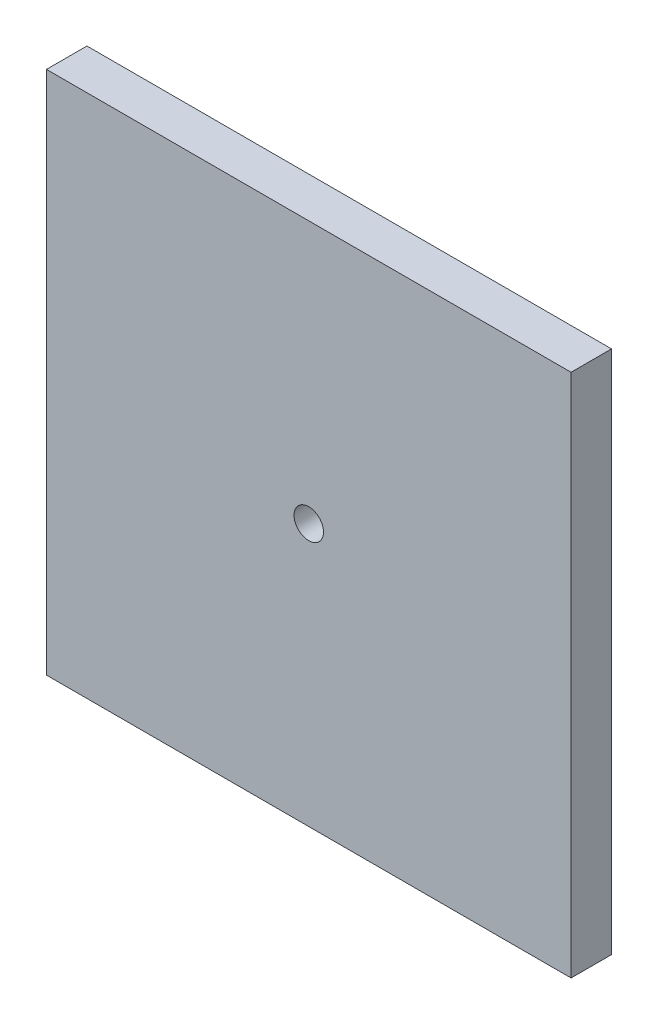
ISO-10303-21;
HEADER;
FILE_DESCRIPTION(('STEP AP214'),'2;1');
FILE_NAME('part.step','',(''),(''),'','','');
FILE_SCHEMA(('AUTOMOTIVE_DESIGN { 1 0 10303 214 1 1 1 1 }'));
ENDSEC;
DATA;
#1=APPLICATION_CONTEXT('core data for automotive mechanical design processes');
#2=APPLICATION_PROTOCOL_DEFINITION('international standard','automotive_design',2000,#1);
#3=PRODUCT_CONTEXT('',#1,'mechanical');
#4=PRODUCT('Part','Part','',(#3));
#5=PRODUCT_RELATED_PRODUCT_CATEGORY('part','',(#4));
#6=PRODUCT_DEFINITION_FORMATION('','',#4);
#7=PRODUCT_DEFINITION_CONTEXT('part definition',#1,'design');
#8=PRODUCT_DEFINITION('design','',#6,#7);
#9=PRODUCT_DEFINITION_SHAPE('','',#8);
#10=(LENGTH_UNIT() NAMED_UNIT(*) SI_UNIT(.MILLI.,.METRE.));
#11=(NAMED_UNIT(*) PLANE_ANGLE_UNIT() SI_UNIT($,.RADIAN.));
#12=(NAMED_UNIT(*) SI_UNIT($,.STERADIAN.) SOLID_ANGLE_UNIT());
#13=UNCERTAINTY_MEASURE_WITH_UNIT(LENGTH_MEASURE(1.E-05),#10,'distance_accuracy_value','');
#14=(GEOMETRIC_REPRESENTATION_CONTEXT(3) GLOBAL_UNCERTAINTY_ASSIGNED_CONTEXT((#13)) GLOBAL_UNIT_ASSIGNED_CONTEXT((#10,
#11,#12)) REPRESENTATION_CONTEXT('',''));
#15=CARTESIAN_POINT('',(0.,0.,0.));
#16=DIRECTION('',(0.,0.,1.));
#17=DIRECTION('',(1.,0.,0.));
#18=AXIS2_PLACEMENT_3D('',#15,#16,#17);
#19=CARTESIAN_POINT('',(56.5785,0.,8.73125));
#20=DIRECTION('',(1.,0.,0.));
#21=DIRECTION('',(0.,1.,0.));
#22=AXIS2_PLACEMENT_3D('',#19,#20,#21);
#23=PLANE('',#22);
#24=DIRECTION('',(0.,-1.,0.));
#25=VECTOR('',#24,1.);
#26=CARTESIAN_POINT('',(56.5785,0.,0.));
#27=LINE('',#26,#25);
#28=CARTESIAN_POINT('',(56.5785,56.5785,0.));
#29=VERTEX_POINT('',#28);
#30=CARTESIAN_POINT('',(56.5785,-56.5785,0.));
#31=VERTEX_POINT('',#30);
#32=EDGE_CURVE('E106',#29,#31,#27,.T.);
#33=ORIENTED_EDGE('',*,*,#32,.F.);
#34=DIRECTION('',(0.,0.,-1.));
#35=VECTOR('',#34,1.);
#36=CARTESIAN_POINT('',(56.5785,56.5785,8.73125));
#37=LINE('',#36,#35);
#38=CARTESIAN_POINT('',(56.5785,56.5785,8.73125));
#39=VERTEX_POINT('',#38);
#40=EDGE_CURVE('E11',#39,#29,#37,.T.);
#41=ORIENTED_EDGE('',*,*,#40,.F.);
#42=DIRECTION('',(0.,-1.,0.));
#43=VECTOR('',#42,1.);
#44=CARTESIAN_POINT('',(56.5785,0.,8.73125));
#45=LINE('',#44,#43);
#46=CARTESIAN_POINT('',(56.5785,-56.5785,8.73125));
#47=VERTEX_POINT('',#46);
#48=EDGE_CURVE('E96',#39,#47,#45,.T.);
#49=ORIENTED_EDGE('',*,*,#48,.T.);
#50=DIRECTION('',(0.,0.,-1.));
#51=VECTOR('',#50,1.);
#52=CARTESIAN_POINT('',(56.5785,-56.5785,8.73125));
#53=LINE('',#52,#51);
#54=EDGE_CURVE('E76',#47,#31,#53,.T.);
#55=ORIENTED_EDGE('',*,*,#54,.T.);
#56=EDGE_LOOP('',(#33,#41,#49,#55));
#57=FACE_BOUND('',#56,.T.);
#58=ADVANCED_FACE('F38',(#57),#23,.T.);
#59=CARTESIAN_POINT('',(0.,56.5785,8.73125));
#60=DIRECTION('',(0.,1.,0.));
#61=DIRECTION('',(0.,0.,1.));
#62=AXIS2_PLACEMENT_3D('',#59,#60,#61);
#63=PLANE('',#62);
#64=DIRECTION('',(1.,0.,0.));
#65=VECTOR('',#64,1.);
#66=CARTESIAN_POINT('',(0.,56.5785,0.));
#67=LINE('',#66,#65);
#68=CARTESIAN_POINT('',(-56.5785,56.5785,0.));
#69=VERTEX_POINT('',#68);
#70=EDGE_CURVE('E89',#69,#29,#67,.T.);
#71=ORIENTED_EDGE('',*,*,#70,.F.);
#72=DIRECTION('',(0.,0.,-1.));
#73=VECTOR('',#72,1.);
#74=CARTESIAN_POINT('',(-56.5785,56.5785,8.73125));
#75=LINE('',#74,#73);
#76=CARTESIAN_POINT('',(-56.5785,56.5785,8.73125));
#77=VERTEX_POINT('',#76);
#78=EDGE_CURVE('E46',#77,#69,#75,.T.);
#79=ORIENTED_EDGE('',*,*,#78,.F.);
#80=DIRECTION('',(1.,0.,0.));
#81=VECTOR('',#80,1.);
#82=CARTESIAN_POINT('',(0.,56.5785,8.73125));
#83=LINE('',#82,#81);
#84=EDGE_CURVE('E87',#77,#39,#83,.T.);
#85=ORIENTED_EDGE('',*,*,#84,.T.);
#86=ORIENTED_EDGE('',*,*,#40,.T.);
#87=EDGE_LOOP('',(#71,#79,#85,#86));
#88=FACE_BOUND('',#87,.T.);
#89=ADVANCED_FACE('F85',(#88),#63,.T.);
#90=CARTESIAN_POINT('',(-56.5785000000002,1.87350135405496E-13,8.73125));
#91=DIRECTION('',(1.,0.,0.));
#92=DIRECTION('',(0.,1.,0.));
#93=AXIS2_PLACEMENT_3D('',#90,#91,#92);
#94=PLANE('',#93);
#95=DIRECTION('',(0.,-1.,0.));
#96=VECTOR('',#95,1.);
#97=CARTESIAN_POINT('',(-56.5785000000002,1.87350135405496E-13,0.));
#98=LINE('',#97,#96);
#99=CARTESIAN_POINT('',(-56.5785000000004,-56.5785,0.));
#100=VERTEX_POINT('',#99);
#101=EDGE_CURVE('E69',#69,#100,#98,.T.);
#102=ORIENTED_EDGE('',*,*,#101,.T.);
#103=DIRECTION('',(0.,0.,-1.));
#104=VECTOR('',#103,1.);
#105=CARTESIAN_POINT('',(-56.5785000000004,-56.5785,8.73125));
#106=LINE('',#105,#104);
#107=CARTESIAN_POINT('',(-56.5785000000004,-56.5785,8.73125));
#108=VERTEX_POINT('',#107);
#109=EDGE_CURVE('E90',#108,#100,#106,.T.);
#110=ORIENTED_EDGE('',*,*,#109,.F.);
#111=DIRECTION('',(0.,-1.,0.));
#112=VECTOR('',#111,1.);
#113=CARTESIAN_POINT('',(-56.5785000000002,1.87350135405496E-13,8.73125));
#114=LINE('',#113,#112);
#115=EDGE_CURVE('E91',#77,#108,#114,.T.);
#116=ORIENTED_EDGE('',*,*,#115,.F.);
#117=ORIENTED_EDGE('',*,*,#78,.T.);
#118=EDGE_LOOP('',(#102,#110,#116,#117));
#119=FACE_BOUND('',#118,.T.);
#120=ADVANCED_FACE('F92',(#119),#94,.F.);
#121=CARTESIAN_POINT('',(0.,-56.5785,8.73125));
#122=DIRECTION('',(0.,1.,0.));
#123=DIRECTION('',(0.,0.,1.));
#124=AXIS2_PLACEMENT_3D('',#121,#122,#123);
#125=PLANE('',#124);
#126=DIRECTION('',(1.,0.,0.));
#127=VECTOR('',#126,1.);
#128=CARTESIAN_POINT('',(0.,-56.5785,0.));
#129=LINE('',#128,#127);
#130=EDGE_CURVE('E112',#100,#31,#129,.T.);
#131=ORIENTED_EDGE('',*,*,#130,.T.);
#132=ORIENTED_EDGE('',*,*,#54,.F.);
#133=DIRECTION('',(1.,0.,0.));
#134=VECTOR('',#133,1.);
#135=CARTESIAN_POINT('',(0.,-56.5785,8.73125));
#136=LINE('',#135,#134);
#137=EDGE_CURVE('E54',#108,#47,#136,.T.);
#138=ORIENTED_EDGE('',*,*,#137,.F.);
#139=ORIENTED_EDGE('',*,*,#109,.T.);
#140=EDGE_LOOP('',(#131,#132,#138,#139));
#141=FACE_BOUND('',#140,.T.);
#142=ADVANCED_FACE('F119',(#141),#125,.F.);
#143=CARTESIAN_POINT('',(0.,0.,8.73125));
#144=DIRECTION('',(0.,0.,-1.));
#145=DIRECTION('',(-1.,0.,0.));
#146=AXIS2_PLACEMENT_3D('',#143,#144,#145);
#147=CYLINDRICAL_SURFACE('',#146,3.175);
#148=CARTESIAN_POINT('',(0.,0.,8.73125));
#149=DIRECTION('',(0.,0.,1.));
#150=DIRECTION('',(1.,0.,0.));
#151=AXIS2_PLACEMENT_3D('',#148,#149,#150);
#152=CIRCLE('',#151,3.175);
#153=CARTESIAN_POINT('',(3.175,0.,8.73125));
#154=VERTEX_POINT('',#153);
#155=EDGE_CURVE('E103',#154,#154,#152,.T.);
#156=ORIENTED_EDGE('',*,*,#155,.T.);
#157=EDGE_LOOP('',(#156));
#158=FACE_BOUND('',#157,.T.);
#159=CARTESIAN_POINT('',(0.,0.,0.));
#160=DIRECTION('',(0.,0.,1.));
#161=DIRECTION('',(1.,0.,0.));
#162=AXIS2_PLACEMENT_3D('',#159,#160,#161);
#163=CIRCLE('',#162,3.175);
#164=CARTESIAN_POINT('',(3.175,0.,0.));
#165=VERTEX_POINT('',#164);
#166=EDGE_CURVE('E98',#165,#165,#163,.T.);
#167=ORIENTED_EDGE('',*,*,#166,.F.);
#168=EDGE_LOOP('',(#167));
#169=FACE_BOUND('',#168,.T.);
#170=ADVANCED_FACE('F134',(#158,#169),#147,.F.);
#171=CARTESIAN_POINT('',(0.,0.,8.73125));
#172=DIRECTION('',(0.,0.,1.));
#173=DIRECTION('',(1.,0.,0.));
#174=AXIS2_PLACEMENT_3D('',#171,#172,#173);
#175=PLANE('',#174);
#176=ORIENTED_EDGE('',*,*,#48,.F.);
#177=ORIENTED_EDGE('',*,*,#84,.F.);
#178=ORIENTED_EDGE('',*,*,#115,.T.);
#179=ORIENTED_EDGE('',*,*,#137,.T.);
#180=EDGE_LOOP('',(#176,#177,#178,#179));
#181=FACE_BOUND('',#180,.T.);
#182=ORIENTED_EDGE('',*,*,#155,.F.);
#183=EDGE_LOOP('',(#182));
#184=FACE_BOUND('',#183,.T.);
#185=ADVANCED_FACE('F94',(#181,#184),#175,.T.);
#186=CARTESIAN_POINT('',(0.,0.,0.));
#187=DIRECTION('',(0.,0.,1.));
#188=DIRECTION('',(1.,0.,0.));
#189=AXIS2_PLACEMENT_3D('',#186,#187,#188);
#190=PLANE('',#189);
#191=CARTESIAN_POINT('',(43.8785,-43.8785,0.));
#192=DIRECTION('',(0.,0.,1.));
#193=DIRECTION('',(1.,0.,0.));
#194=AXIS2_PLACEMENT_3D('',#191,#192,#193);
#195=CIRCLE('',#194,3.17500000000001);
#196=CARTESIAN_POINT('',(47.0535000000001,-43.8785,0.));
#197=VERTEX_POINT('',#196);
#198=EDGE_CURVE('E180',#197,#197,#195,.T.);
#199=ORIENTED_EDGE('',*,*,#198,.T.);
#200=EDGE_LOOP('',(#199));
#201=FACE_BOUND('',#200,.T.);
#202=CARTESIAN_POINT('',(-43.8785,-43.8785,0.));
#203=DIRECTION('',(0.,0.,1.));
#204=DIRECTION('',(1.,0.,0.));
#205=AXIS2_PLACEMENT_3D('',#202,#203,#204);
#206=CIRCLE('',#205,3.17499999999998);
#207=CARTESIAN_POINT('',(-40.7035,-43.8785,0.));
#208=VERTEX_POINT('',#207);
#209=EDGE_CURVE('E179',#208,#208,#206,.T.);
#210=ORIENTED_EDGE('',*,*,#209,.T.);
#211=EDGE_LOOP('',(#210));
#212=FACE_BOUND('',#211,.T.);
#213=CARTESIAN_POINT('',(-43.8785,43.8785,0.));
#214=DIRECTION('',(0.,0.,1.));
#215=DIRECTION('',(1.,0.,0.));
#216=AXIS2_PLACEMENT_3D('',#213,#214,#215);
#217=CIRCLE('',#216,3.17500000000001);
#218=CARTESIAN_POINT('',(-40.7035,43.8785,0.));
#219=VERTEX_POINT('',#218);
#220=EDGE_CURVE('E189',#219,#219,#217,.T.);
#221=ORIENTED_EDGE('',*,*,#220,.T.);
#222=EDGE_LOOP('',(#221));
#223=FACE_BOUND('',#222,.T.);
#224=CARTESIAN_POINT('',(43.8785,43.8785,0.));
#225=DIRECTION('',(0.,0.,1.));
#226=DIRECTION('',(1.,0.,0.));
#227=AXIS2_PLACEMENT_3D('',#224,#225,#226);
#228=CIRCLE('',#227,3.17499999999998);
#229=CARTESIAN_POINT('',(47.0535,43.8785,0.));
#230=VERTEX_POINT('',#229);
#231=EDGE_CURVE('E194',#230,#230,#228,.T.);
#232=ORIENTED_EDGE('',*,*,#231,.T.);
#233=EDGE_LOOP('',(#232));
#234=FACE_BOUND('',#233,.T.);
#235=ORIENTED_EDGE('',*,*,#32,.T.);
#236=ORIENTED_EDGE('',*,*,#130,.F.);
#237=ORIENTED_EDGE('',*,*,#101,.F.);
#238=ORIENTED_EDGE('',*,*,#70,.T.);
#239=EDGE_LOOP('',(#235,#236,#237,#238));
#240=FACE_BOUND('',#239,.T.);
#241=ORIENTED_EDGE('',*,*,#166,.T.);
#242=EDGE_LOOP('',(#241));
#243=FACE_BOUND('',#242,.T.);
#244=ADVANCED_FACE('F121',(#201,#212,#223,#234,#240,#243),#190,.F.);
#245=CARTESIAN_POINT('',(43.8785,43.8785,-9.398));
#246=DIRECTION('',(0.,0.,1.));
#247=DIRECTION('',(1.,0.,0.));
#248=AXIS2_PLACEMENT_3D('',#245,#246,#247);
#249=CYLINDRICAL_SURFACE('',#248,3.17499999999998);
#250=CARTESIAN_POINT('',(43.8785,43.8785,-9.398));
#251=DIRECTION('',(0.,0.,1.));
#252=DIRECTION('',(1.,0.,0.));
#253=AXIS2_PLACEMENT_3D('',#250,#251,#252);
#254=CIRCLE('',#253,3.17499999999998);
#255=CARTESIAN_POINT('',(47.0535,43.8785,-9.398));
#256=VERTEX_POINT('',#255);
#257=EDGE_CURVE('E109',#256,#256,#254,.T.);
#258=ORIENTED_EDGE('',*,*,#257,.T.);
#259=EDGE_LOOP('',(#258));
#260=FACE_BOUND('',#259,.T.);
#261=ORIENTED_EDGE('',*,*,#231,.F.);
#262=EDGE_LOOP('',(#261));
#263=FACE_BOUND('',#262,.T.);
#264=ADVANCED_FACE('F140',(#260,#263),#249,.T.);
#265=CARTESIAN_POINT('',(0.,0.,-9.398));
#266=DIRECTION('',(0.,0.,1.));
#267=DIRECTION('',(1.,0.,0.));
#268=AXIS2_PLACEMENT_3D('',#265,#266,#267);
#269=PLANE('',#268);
#270=ORIENTED_EDGE('',*,*,#257,.F.);
#271=EDGE_LOOP('',(#270));
#272=FACE_BOUND('',#271,.T.);
#273=ADVANCED_FACE('F146',(#272),#269,.F.);
#274=CARTESIAN_POINT('',(-43.8785,43.8785,-9.398));
#275=DIRECTION('',(0.,0.,1.));
#276=DIRECTION('',(1.,0.,0.));
#277=AXIS2_PLACEMENT_3D('',#274,#275,#276);
#278=CYLINDRICAL_SURFACE('',#277,3.17500000000001);
#279=CARTESIAN_POINT('',(-43.8785,43.8785,-9.398));
#280=DIRECTION('',(0.,0.,1.));
#281=DIRECTION('',(1.,0.,0.));
#282=AXIS2_PLACEMENT_3D('',#279,#280,#281);
#283=CIRCLE('',#282,3.17500000000001);
#284=CARTESIAN_POINT('',(-40.7035,43.8785,-9.398));
#285=VERTEX_POINT('',#284);
#286=EDGE_CURVE('E191',#285,#285,#283,.T.);
#287=ORIENTED_EDGE('',*,*,#286,.T.);
#288=EDGE_LOOP('',(#287));
#289=FACE_BOUND('',#288,.T.);
#290=ORIENTED_EDGE('',*,*,#220,.F.);
#291=EDGE_LOOP('',(#290));
#292=FACE_BOUND('',#291,.T.);
#293=ADVANCED_FACE('F150',(#289,#292),#278,.T.);
#294=CARTESIAN_POINT('',(0.,0.,-9.398));
#295=DIRECTION('',(0.,0.,1.));
#296=DIRECTION('',(1.,0.,0.));
#297=AXIS2_PLACEMENT_3D('',#294,#295,#296);
#298=PLANE('',#297);
#299=ORIENTED_EDGE('',*,*,#286,.F.);
#300=EDGE_LOOP('',(#299));
#301=FACE_BOUND('',#300,.T.);
#302=ADVANCED_FACE('F154',(#301),#298,.F.);
#303=CARTESIAN_POINT('',(-43.8785,-43.8785,-9.398));
#304=DIRECTION('',(0.,0.,1.));
#305=DIRECTION('',(1.,0.,0.));
#306=AXIS2_PLACEMENT_3D('',#303,#304,#305);
#307=CYLINDRICAL_SURFACE('',#306,3.17499999999998);
#308=CARTESIAN_POINT('',(-43.8785,-43.8785,-9.398));
#309=DIRECTION('',(0.,0.,1.));
#310=DIRECTION('',(1.,0.,0.));
#311=AXIS2_PLACEMENT_3D('',#308,#309,#310);
#312=CIRCLE('',#311,3.17499999999998);
#313=CARTESIAN_POINT('',(-40.7035,-43.8785,-9.398));
#314=VERTEX_POINT('',#313);
#315=EDGE_CURVE('E183',#314,#314,#312,.T.);
#316=ORIENTED_EDGE('',*,*,#315,.T.);
#317=EDGE_LOOP('',(#316));
#318=FACE_BOUND('',#317,.T.);
#319=ORIENTED_EDGE('',*,*,#209,.F.);
#320=EDGE_LOOP('',(#319));
#321=FACE_BOUND('',#320,.T.);
#322=ADVANCED_FACE('F158',(#318,#321),#307,.T.);
#323=CARTESIAN_POINT('',(0.,0.,-9.398));
#324=DIRECTION('',(0.,0.,1.));
#325=DIRECTION('',(1.,0.,0.));
#326=AXIS2_PLACEMENT_3D('',#323,#324,#325);
#327=PLANE('',#326);
#328=ORIENTED_EDGE('',*,*,#315,.F.);
#329=EDGE_LOOP('',(#328));
#330=FACE_BOUND('',#329,.T.);
#331=ADVANCED_FACE('F162',(#330),#327,.F.);
#332=CARTESIAN_POINT('',(43.8785,-43.8785,-9.398));
#333=DIRECTION('',(0.,0.,1.));
#334=DIRECTION('',(1.,0.,0.));
#335=AXIS2_PLACEMENT_3D('',#332,#333,#334);
#336=CYLINDRICAL_SURFACE('',#335,3.17500000000001);
#337=CARTESIAN_POINT('',(43.8785,-43.8785,-9.398));
#338=DIRECTION('',(0.,0.,1.));
#339=DIRECTION('',(1.,0.,0.));
#340=AXIS2_PLACEMENT_3D('',#337,#338,#339);
#341=CIRCLE('',#340,3.17500000000001);
#342=CARTESIAN_POINT('',(47.0535000000001,-43.8785,-9.398));
#343=VERTEX_POINT('',#342);
#344=EDGE_CURVE('E178',#343,#343,#341,.T.);
#345=ORIENTED_EDGE('',*,*,#344,.T.);
#346=EDGE_LOOP('',(#345));
#347=FACE_BOUND('',#346,.T.);
#348=ORIENTED_EDGE('',*,*,#198,.F.);
#349=EDGE_LOOP('',(#348));
#350=FACE_BOUND('',#349,.T.);
#351=ADVANCED_FACE('F166',(#347,#350),#336,.T.);
#352=CARTESIAN_POINT('',(0.,0.,-9.398));
#353=DIRECTION('',(0.,0.,1.));
#354=DIRECTION('',(1.,0.,0.));
#355=AXIS2_PLACEMENT_3D('',#352,#353,#354);
#356=PLANE('',#355);
#357=ORIENTED_EDGE('',*,*,#344,.F.);
#358=EDGE_LOOP('',(#357));
#359=FACE_BOUND('',#358,.T.);
#360=ADVANCED_FACE('F170',(#359),#356,.F.);
#361=CLOSED_SHELL('',(#58,#89,#120,#142,#170,#185,#244,#264,#273,#293,#302,#322,#331,#351,#360));
#362=MANIFOLD_SOLID_BREP('B2',#361);
#363=ADVANCED_BREP_SHAPE_REPRESENTATION('',(#18,#362),#14);
#364=SHAPE_DEFINITION_REPRESENTATION(#9,#363);
ENDSEC;
END-ISO-10303-21;
